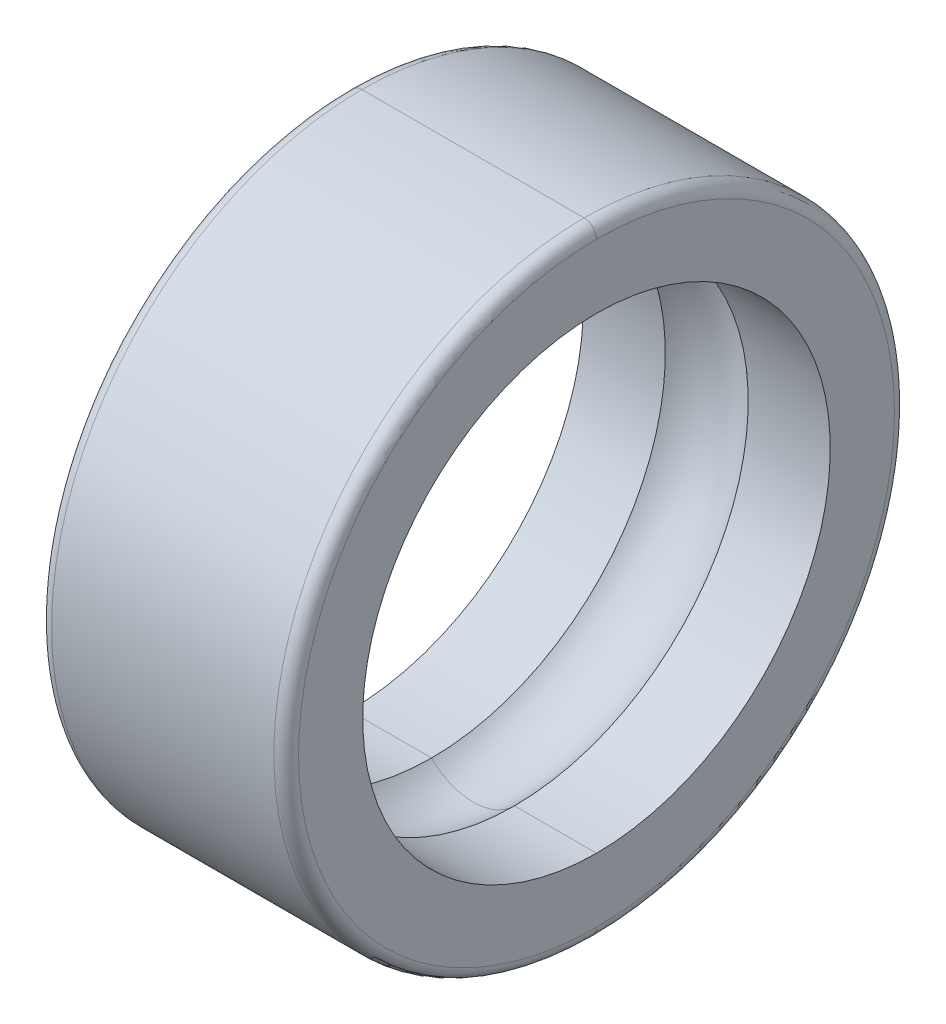
ISO-10303-21;
HEADER;
FILE_DESCRIPTION(('STEP AP214'),'2;1');
FILE_NAME('part.step','',(''),(''),'','','');
FILE_SCHEMA(('AUTOMOTIVE_DESIGN { 1 0 10303 214 1 1 1 1 }'));
ENDSEC;
DATA;
#1=APPLICATION_CONTEXT('core data for automotive mechanical design processes');
#2=APPLICATION_PROTOCOL_DEFINITION('international standard','automotive_design',2000,#1);
#3=PRODUCT_CONTEXT('',#1,'mechanical');
#4=PRODUCT('Part','Part','',(#3));
#5=PRODUCT_RELATED_PRODUCT_CATEGORY('part','',(#4));
#6=PRODUCT_DEFINITION_FORMATION('','',#4);
#7=PRODUCT_DEFINITION_CONTEXT('part definition',#1,'design');
#8=PRODUCT_DEFINITION('design','',#6,#7);
#9=PRODUCT_DEFINITION_SHAPE('','',#8);
#10=(LENGTH_UNIT() NAMED_UNIT(*) SI_UNIT(.MILLI.,.METRE.));
#11=(NAMED_UNIT(*) PLANE_ANGLE_UNIT() SI_UNIT($,.RADIAN.));
#12=(NAMED_UNIT(*) SI_UNIT($,.STERADIAN.) SOLID_ANGLE_UNIT());
#13=UNCERTAINTY_MEASURE_WITH_UNIT(LENGTH_MEASURE(1.E-05),#10,'distance_accuracy_value','');
#14=(GEOMETRIC_REPRESENTATION_CONTEXT(3) GLOBAL_UNCERTAINTY_ASSIGNED_CONTEXT((#13)) GLOBAL_UNIT_ASSIGNED_CONTEXT((#10,
#11,#12)) REPRESENTATION_CONTEXT('',''));
#15=CARTESIAN_POINT('',(0.,0.,0.));
#16=DIRECTION('',(0.,0.,1.));
#17=DIRECTION('',(1.,0.,0.));
#18=AXIS2_PLACEMENT_3D('',#15,#16,#17);
#19=CARTESIAN_POINT('',(-0.544829999999999,0.,0.));
#20=DIRECTION('',(1.,0.,0.));
#21=DIRECTION('',(0.,-1.,0.));
#22=AXIS2_PLACEMENT_3D('',#19,#20,#21);
#23=CYLINDRICAL_SURFACE('',#22,0.9376537);
#24=CARTESIAN_POINT('',(0.495300000000001,0.,0.));
#25=DIRECTION('',(1.,0.,0.));
#26=DIRECTION('',(0.,1.,0.));
#27=AXIS2_PLACEMENT_3D('',#24,#25,#26);
#28=CIRCLE('',#27,0.9376537);
#29=CARTESIAN_POINT('',(0.4953,0.9376537,0.));
#30=VERTEX_POINT('',#29);
#31=CARTESIAN_POINT('',(0.4953,-0.9376537,0.));
#32=VERTEX_POINT('',#31);
#33=EDGE_CURVE('E97',#30,#32,#28,.T.);
#34=ORIENTED_EDGE('',*,*,#33,.T.);
#35=DIRECTION('',(1.,0.,0.));
#36=VECTOR('',#35,1.);
#37=CARTESIAN_POINT('',(0.166246026530892,-0.9376537,0.));
#38=LINE('',#37,#36);
#39=CARTESIAN_POINT('',(0.166246026530892,-0.9376537,0.));
#40=VERTEX_POINT('',#39);
#41=EDGE_CURVE('E11',#40,#32,#38,.T.);
#42=ORIENTED_EDGE('',*,*,#41,.F.);
#43=CARTESIAN_POINT('',(0.166246026530892,0.,0.));
#44=DIRECTION('',(1.,0.,0.));
#45=DIRECTION('',(0.,1.,0.));
#46=AXIS2_PLACEMENT_3D('',#43,#44,#45);
#47=CIRCLE('',#46,0.9376537);
#48=CARTESIAN_POINT('',(0.166246026530892,0.9376537,0.));
#49=VERTEX_POINT('',#48);
#50=EDGE_CURVE('E19',#49,#40,#47,.T.);
#51=ORIENTED_EDGE('',*,*,#50,.F.);
#52=DIRECTION('',(1.,0.,0.));
#53=VECTOR('',#52,1.);
#54=CARTESIAN_POINT('',(0.166246026530892,0.9376537,0.));
#55=LINE('',#54,#53);
#56=EDGE_CURVE('E24',#49,#30,#55,.T.);
#57=ORIENTED_EDGE('',*,*,#56,.T.);
#58=EDGE_LOOP('',(#34,#42,#51,#57));
#59=FACE_BOUND('',#58,.T.);
#60=ADVANCED_FACE('F16',(#59),#23,.F.);
#61=CARTESIAN_POINT('',(-0.544829999999999,0.,0.));
#62=DIRECTION('',(1.,0.,0.));
#63=DIRECTION('',(0.,-1.,0.));
#64=AXIS2_PLACEMENT_3D('',#61,#62,#63);
#65=CYLINDRICAL_SURFACE('',#64,0.9376537);
#66=CARTESIAN_POINT('',(0.166246026530892,0.,0.));
#67=DIRECTION('',(-1.,0.,0.));
#68=DIRECTION('',(0.,1.,0.));
#69=AXIS2_PLACEMENT_3D('',#66,#67,#68);
#70=CIRCLE('',#69,0.9376537);
#71=EDGE_CURVE('E93',#49,#40,#70,.T.);
#72=ORIENTED_EDGE('',*,*,#71,.T.);
#73=ORIENTED_EDGE('',*,*,#41,.T.);
#74=CARTESIAN_POINT('',(0.495300000000001,0.,0.));
#75=DIRECTION('',(-1.,0.,0.));
#76=DIRECTION('',(0.,1.,0.));
#77=AXIS2_PLACEMENT_3D('',#74,#75,#76);
#78=CIRCLE('',#77,0.9376537);
#79=EDGE_CURVE('E95',#30,#32,#78,.T.);
#80=ORIENTED_EDGE('',*,*,#79,.F.);
#81=ORIENTED_EDGE('',*,*,#56,.F.);
#82=EDGE_LOOP('',(#72,#73,#80,#81));
#83=FACE_BOUND('',#82,.T.);
#84=ADVANCED_FACE('F91',(#83),#65,.F.);
#85=CARTESIAN_POINT('',(0.4953,0.,0.));
#86=DIRECTION('',(1.,0.,0.));
#87=DIRECTION('',(0.,-1.,0.));
#88=AXIS2_PLACEMENT_3D('',#85,#86,#87);
#89=PLANE('',#88);
#90=ORIENTED_EDGE('',*,*,#33,.F.);
#91=ORIENTED_EDGE('',*,*,#79,.T.);
#92=EDGE_LOOP('',(#90,#91));
#93=FACE_BOUND('',#92,.T.);
#94=CARTESIAN_POINT('',(0.4953,0.,0.));
#95=DIRECTION('',(-1.,0.,0.));
#96=DIRECTION('',(0.,1.,0.));
#97=AXIS2_PLACEMENT_3D('',#94,#95,#96);
#98=CIRCLE('',#97,1.19507);
#99=CARTESIAN_POINT('',(0.4953,1.19507,0.));
#100=VERTEX_POINT('',#99);
#101=CARTESIAN_POINT('',(0.4953,-1.19507,0.));
#102=VERTEX_POINT('',#101);
#103=EDGE_CURVE('E115',#100,#102,#98,.T.);
#104=ORIENTED_EDGE('',*,*,#103,.F.);
#105=CARTESIAN_POINT('',(0.4953,0.,0.));
#106=DIRECTION('',(1.,0.,0.));
#107=DIRECTION('',(0.,1.,0.));
#108=AXIS2_PLACEMENT_3D('',#105,#106,#107);
#109=CIRCLE('',#108,1.19507);
#110=EDGE_CURVE('E113',#100,#102,#109,.T.);
#111=ORIENTED_EDGE('',*,*,#110,.T.);
#112=EDGE_LOOP('',(#104,#111));
#113=FACE_BOUND('',#112,.T.);
#114=ADVANCED_FACE('F174',(#93,#113),#89,.T.);
#115=CARTESIAN_POINT('',(0.44577,0.,0.));
#116=DIRECTION('',(1.,0.,0.));
#117=DIRECTION('',(0.,-1.,0.));
#118=AXIS2_PLACEMENT_3D('',#115,#116,#117);
#119=TOROIDAL_SURFACE('',#118,1.19507,0.04953);
#120=CARTESIAN_POINT('',(0.445769999999999,0.,0.));
#121=DIRECTION('',(1.,0.,0.));
#122=DIRECTION('',(0.,1.,0.));
#123=AXIS2_PLACEMENT_3D('',#120,#121,#122);
#124=CIRCLE('',#123,1.2446);
#125=CARTESIAN_POINT('',(0.44577,1.2446,0.));
#126=VERTEX_POINT('',#125);
#127=CARTESIAN_POINT('',(0.44577,-1.2446,0.));
#128=VERTEX_POINT('',#127);
#129=EDGE_CURVE('E128',#126,#128,#124,.T.);
#130=ORIENTED_EDGE('',*,*,#129,.T.);
#131=CARTESIAN_POINT('',(0.44577,-1.19507,0.));
#132=DIRECTION('',(0.,0.,-1.));
#133=DIRECTION('',(1.,0.,0.));
#134=AXIS2_PLACEMENT_3D('',#131,#132,#133);
#135=CIRCLE('',#134,0.04953);
#136=EDGE_CURVE('E118',#102,#128,#135,.T.);
#137=ORIENTED_EDGE('',*,*,#136,.F.);
#138=ORIENTED_EDGE('',*,*,#110,.F.);
#139=CARTESIAN_POINT('',(0.44577,1.19507,0.));
#140=DIRECTION('',(0.,0.,1.));
#141=DIRECTION('',(1.,0.,0.));
#142=AXIS2_PLACEMENT_3D('',#139,#140,#141);
#143=CIRCLE('',#142,0.04953);
#144=EDGE_CURVE('E121',#100,#126,#143,.T.);
#145=ORIENTED_EDGE('',*,*,#144,.T.);
#146=EDGE_LOOP('',(#130,#137,#138,#145));
#147=FACE_BOUND('',#146,.T.);
#148=ADVANCED_FACE('F178',(#147),#119,.T.);
#149=CARTESIAN_POINT('',(0.44577,0.,0.));
#150=DIRECTION('',(1.,0.,0.));
#151=DIRECTION('',(0.,-1.,0.));
#152=AXIS2_PLACEMENT_3D('',#149,#150,#151);
#153=TOROIDAL_SURFACE('',#152,1.19507,0.04953);
#154=ORIENTED_EDGE('',*,*,#103,.T.);
#155=ORIENTED_EDGE('',*,*,#136,.T.);
#156=CARTESIAN_POINT('',(0.445769999999999,0.,0.));
#157=DIRECTION('',(-1.,0.,0.));
#158=DIRECTION('',(0.,1.,0.));
#159=AXIS2_PLACEMENT_3D('',#156,#157,#158);
#160=CIRCLE('',#159,1.2446);
#161=EDGE_CURVE('E123',#126,#128,#160,.T.);
#162=ORIENTED_EDGE('',*,*,#161,.F.);
#163=ORIENTED_EDGE('',*,*,#144,.F.);
#164=EDGE_LOOP('',(#154,#155,#162,#163));
#165=FACE_BOUND('',#164,.T.);
#166=ADVANCED_FACE('F184',(#165),#153,.T.);
#167=CARTESIAN_POINT('',(-0.544829999999999,0.,0.));
#168=DIRECTION('',(1.,0.,0.));
#169=DIRECTION('',(0.,-1.,0.));
#170=AXIS2_PLACEMENT_3D('',#167,#168,#169);
#171=CYLINDRICAL_SURFACE('',#170,1.2446);
#172=ORIENTED_EDGE('',*,*,#161,.T.);
#173=DIRECTION('',(-1.,0.,0.));
#174=VECTOR('',#173,1.);
#175=CARTESIAN_POINT('',(0.44577,-1.2446,0.));
#176=LINE('',#175,#174);
#177=CARTESIAN_POINT('',(-0.44577,-1.2446,0.));
#178=VERTEX_POINT('',#177);
#179=EDGE_CURVE('E126',#128,#178,#176,.T.);
#180=ORIENTED_EDGE('',*,*,#179,.T.);
#181=CARTESIAN_POINT('',(-0.44577,0.,0.));
#182=DIRECTION('',(-1.,0.,0.));
#183=DIRECTION('',(0.,1.,0.));
#184=AXIS2_PLACEMENT_3D('',#181,#182,#183);
#185=CIRCLE('',#184,1.2446);
#186=CARTESIAN_POINT('',(-0.44577,1.2446,0.));
#187=VERTEX_POINT('',#186);
#188=EDGE_CURVE('E136',#187,#178,#185,.T.);
#189=ORIENTED_EDGE('',*,*,#188,.F.);
#190=DIRECTION('',(-1.,0.,0.));
#191=VECTOR('',#190,1.);
#192=CARTESIAN_POINT('',(0.44577,1.2446,0.));
#193=LINE('',#192,#191);
#194=EDGE_CURVE('E129',#126,#187,#193,.T.);
#195=ORIENTED_EDGE('',*,*,#194,.F.);
#196=EDGE_LOOP('',(#172,#180,#189,#195));
#197=FACE_BOUND('',#196,.T.);
#198=ADVANCED_FACE('F188',(#197),#171,.T.);
#199=CARTESIAN_POINT('',(-0.544829999999999,0.,0.));
#200=DIRECTION('',(1.,0.,0.));
#201=DIRECTION('',(0.,-1.,0.));
#202=AXIS2_PLACEMENT_3D('',#199,#200,#201);
#203=CYLINDRICAL_SURFACE('',#202,1.2446);
#204=CARTESIAN_POINT('',(-0.44577,0.,0.));
#205=DIRECTION('',(1.,0.,0.));
#206=DIRECTION('',(0.,1.,0.));
#207=AXIS2_PLACEMENT_3D('',#204,#205,#206);
#208=CIRCLE('',#207,1.2446);
#209=EDGE_CURVE('E132',#187,#178,#208,.T.);
#210=ORIENTED_EDGE('',*,*,#209,.T.);
#211=ORIENTED_EDGE('',*,*,#179,.F.);
#212=ORIENTED_EDGE('',*,*,#129,.F.);
#213=ORIENTED_EDGE('',*,*,#194,.T.);
#214=EDGE_LOOP('',(#210,#211,#212,#213));
#215=FACE_BOUND('',#214,.T.);
#216=ADVANCED_FACE('F192',(#215),#203,.T.);
#217=CARTESIAN_POINT('',(-0.44577,0.,0.));
#218=DIRECTION('',(1.,0.,0.));
#219=DIRECTION('',(0.,-1.,0.));
#220=AXIS2_PLACEMENT_3D('',#217,#218,#219);
#221=TOROIDAL_SURFACE('',#220,1.19507,0.04953);
#222=CARTESIAN_POINT('',(-0.4953,0.,0.));
#223=DIRECTION('',(1.,0.,0.));
#224=DIRECTION('',(0.,1.,0.));
#225=AXIS2_PLACEMENT_3D('',#222,#223,#224);
#226=CIRCLE('',#225,1.19507);
#227=CARTESIAN_POINT('',(-0.4953,1.19507,0.));
#228=VERTEX_POINT('',#227);
#229=CARTESIAN_POINT('',(-0.4953,-1.19507,0.));
#230=VERTEX_POINT('',#229);
#231=EDGE_CURVE('E144',#228,#230,#226,.T.);
#232=ORIENTED_EDGE('',*,*,#231,.T.);
#233=CARTESIAN_POINT('',(-0.44577,-1.19507,0.));
#234=DIRECTION('',(0.,0.,-1.));
#235=DIRECTION('',(0.,-1.,0.));
#236=AXIS2_PLACEMENT_3D('',#233,#234,#235);
#237=CIRCLE('',#236,0.04953);
#238=EDGE_CURVE('E139',#178,#230,#237,.T.);
#239=ORIENTED_EDGE('',*,*,#238,.F.);
#240=ORIENTED_EDGE('',*,*,#209,.F.);
#241=CARTESIAN_POINT('',(-0.44577,1.19507,0.));
#242=DIRECTION('',(0.,0.,1.));
#243=DIRECTION('',(0.,1.,0.));
#244=AXIS2_PLACEMENT_3D('',#241,#242,#243);
#245=CIRCLE('',#244,0.04953);
#246=EDGE_CURVE('E142',#187,#228,#245,.T.);
#247=ORIENTED_EDGE('',*,*,#246,.T.);
#248=EDGE_LOOP('',(#232,#239,#240,#247));
#249=FACE_BOUND('',#248,.T.);
#250=ADVANCED_FACE('F196',(#249),#221,.T.);
#251=CARTESIAN_POINT('',(-0.44577,0.,0.));
#252=DIRECTION('',(1.,0.,0.));
#253=DIRECTION('',(0.,-1.,0.));
#254=AXIS2_PLACEMENT_3D('',#251,#252,#253);
#255=TOROIDAL_SURFACE('',#254,1.19507,0.04953);
#256=ORIENTED_EDGE('',*,*,#188,.T.);
#257=ORIENTED_EDGE('',*,*,#238,.T.);
#258=CARTESIAN_POINT('',(-0.4953,0.,0.));
#259=DIRECTION('',(-1.,0.,0.));
#260=DIRECTION('',(0.,1.,0.));
#261=AXIS2_PLACEMENT_3D('',#258,#259,#260);
#262=CIRCLE('',#261,1.19507);
#263=EDGE_CURVE('E146',#228,#230,#262,.T.);
#264=ORIENTED_EDGE('',*,*,#263,.F.);
#265=ORIENTED_EDGE('',*,*,#246,.F.);
#266=EDGE_LOOP('',(#256,#257,#264,#265));
#267=FACE_BOUND('',#266,.T.);
#268=ADVANCED_FACE('F200',(#267),#255,.T.);
#269=CARTESIAN_POINT('',(-0.4953,0.,0.));
#270=DIRECTION('',(1.,0.,0.));
#271=DIRECTION('',(0.,-1.,0.));
#272=AXIS2_PLACEMENT_3D('',#269,#270,#271);
#273=PLANE('',#272);
#274=CARTESIAN_POINT('',(-0.4953,0.,0.));
#275=DIRECTION('',(-1.,0.,0.));
#276=DIRECTION('',(0.,1.,0.));
#277=AXIS2_PLACEMENT_3D('',#274,#275,#276);
#278=CIRCLE('',#277,0.9376537);
#279=CARTESIAN_POINT('',(-0.4953,0.9376537,0.));
#280=VERTEX_POINT('',#279);
#281=CARTESIAN_POINT('',(-0.4953,-0.9376537,0.));
#282=VERTEX_POINT('',#281);
#283=EDGE_CURVE('E149',#280,#282,#278,.T.);
#284=ORIENTED_EDGE('',*,*,#283,.F.);
#285=CARTESIAN_POINT('',(-0.4953,0.,0.));
#286=DIRECTION('',(1.,0.,0.));
#287=DIRECTION('',(0.,1.,0.));
#288=AXIS2_PLACEMENT_3D('',#285,#286,#287);
#289=CIRCLE('',#288,0.9376537);
#290=EDGE_CURVE('E39',#280,#282,#289,.T.);
#291=ORIENTED_EDGE('',*,*,#290,.T.);
#292=EDGE_LOOP('',(#284,#291));
#293=FACE_BOUND('',#292,.T.);
#294=ORIENTED_EDGE('',*,*,#231,.F.);
#295=ORIENTED_EDGE('',*,*,#263,.T.);
#296=EDGE_LOOP('',(#294,#295));
#297=FACE_BOUND('',#296,.T.);
#298=ADVANCED_FACE('F168',(#293,#297),#273,.F.);
#299=CARTESIAN_POINT('',(-0.544829999999999,0.,0.));
#300=DIRECTION('',(1.,0.,0.));
#301=DIRECTION('',(0.,-1.,0.));
#302=AXIS2_PLACEMENT_3D('',#299,#300,#301);
#303=CYLINDRICAL_SURFACE('',#302,0.9376537);
#304=ORIENTED_EDGE('',*,*,#283,.T.);
#305=DIRECTION('',(1.,0.,0.));
#306=VECTOR('',#305,1.);
#307=CARTESIAN_POINT('',(-0.4953,-0.9376537,0.));
#308=LINE('',#307,#306);
#309=CARTESIAN_POINT('',(-0.166246026530892,-0.9376537,0.));
#310=VERTEX_POINT('',#309);
#311=EDGE_CURVE('E32',#282,#310,#308,.T.);
#312=ORIENTED_EDGE('',*,*,#311,.T.);
#313=CARTESIAN_POINT('',(-0.166246026530892,0.,0.));
#314=DIRECTION('',(-1.,0.,0.));
#315=DIRECTION('',(0.,1.,0.));
#316=AXIS2_PLACEMENT_3D('',#313,#314,#315);
#317=CIRCLE('',#316,0.9376537);
#318=CARTESIAN_POINT('',(-0.166246026530892,0.9376537,0.));
#319=VERTEX_POINT('',#318);
#320=EDGE_CURVE('E108',#319,#310,#317,.T.);
#321=ORIENTED_EDGE('',*,*,#320,.F.);
#322=DIRECTION('',(1.,0.,0.));
#323=VECTOR('',#322,1.);
#324=CARTESIAN_POINT('',(-0.4953,0.9376537,0.));
#325=LINE('',#324,#323);
#326=EDGE_CURVE('E88',#280,#319,#325,.T.);
#327=ORIENTED_EDGE('',*,*,#326,.F.);
#328=EDGE_LOOP('',(#304,#312,#321,#327));
#329=FACE_BOUND('',#328,.T.);
#330=ADVANCED_FACE('F157',(#329),#303,.F.);
#331=CARTESIAN_POINT('',(-0.544829999999999,0.,0.));
#332=DIRECTION('',(1.,0.,0.));
#333=DIRECTION('',(0.,-1.,0.));
#334=AXIS2_PLACEMENT_3D('',#331,#332,#333);
#335=CYLINDRICAL_SURFACE('',#334,0.9376537);
#336=CARTESIAN_POINT('',(-0.166246026530892,0.,0.));
#337=DIRECTION('',(1.,0.,0.));
#338=DIRECTION('',(0.,1.,0.));
#339=AXIS2_PLACEMENT_3D('',#336,#337,#338);
#340=CIRCLE('',#339,0.9376537);
#341=EDGE_CURVE('E89',#319,#310,#340,.T.);
#342=ORIENTED_EDGE('',*,*,#341,.T.);
#343=ORIENTED_EDGE('',*,*,#311,.F.);
#344=ORIENTED_EDGE('',*,*,#290,.F.);
#345=ORIENTED_EDGE('',*,*,#326,.T.);
#346=EDGE_LOOP('',(#342,#343,#344,#345));
#347=FACE_BOUND('',#346,.T.);
#348=ADVANCED_FACE('F159',(#347),#335,.F.);
#349=CARTESIAN_POINT('',(0.,0.,0.));
#350=DIRECTION('',(1.,0.,0.));
#351=DIRECTION('',(0.,-1.,0.));
#352=AXIS2_PLACEMENT_3D('',#349,#350,#351);
#353=TOROIDAL_SURFACE('',#352,0.7747,0.232791);
#354=ORIENTED_EDGE('',*,*,#50,.T.);
#355=CARTESIAN_POINT('',(0.,-0.7747,0.));
#356=DIRECTION('',(0.,0.,1.));
#357=DIRECTION('',(-0.714142842854285,-0.7,0.));
#358=AXIS2_PLACEMENT_3D('',#355,#356,#357);
#359=CIRCLE('',#358,0.232791);
#360=EDGE_CURVE('E107',#310,#40,#359,.T.);
#361=ORIENTED_EDGE('',*,*,#360,.F.);
#362=ORIENTED_EDGE('',*,*,#341,.F.);
#363=CARTESIAN_POINT('',(0.,0.7747,0.));
#364=DIRECTION('',(0.,0.,-1.));
#365=DIRECTION('',(-0.714142842854285,0.7,0.));
#366=AXIS2_PLACEMENT_3D('',#363,#364,#365);
#367=CIRCLE('',#366,0.232791);
#368=EDGE_CURVE('E101',#319,#49,#367,.T.);
#369=ORIENTED_EDGE('',*,*,#368,.T.);
#370=EDGE_LOOP('',(#354,#361,#362,#369));
#371=FACE_BOUND('',#370,.T.);
#372=ADVANCED_FACE('F102',(#371),#353,.F.);
#373=CARTESIAN_POINT('',(0.,0.,0.));
#374=DIRECTION('',(1.,0.,0.));
#375=DIRECTION('',(0.,-1.,0.));
#376=AXIS2_PLACEMENT_3D('',#373,#374,#375);
#377=TOROIDAL_SURFACE('',#376,0.7747,0.232791);
#378=ORIENTED_EDGE('',*,*,#320,.T.);
#379=ORIENTED_EDGE('',*,*,#360,.T.);
#380=ORIENTED_EDGE('',*,*,#71,.F.);
#381=ORIENTED_EDGE('',*,*,#368,.F.);
#382=EDGE_LOOP('',(#378,#379,#380,#381));
#383=FACE_BOUND('',#382,.T.);
#384=ADVANCED_FACE('F106',(#383),#377,.F.);
#385=CLOSED_SHELL('',(#60,#84,#114,#148,#166,#198,#216,#250,#268,#298,#330,#348,#372,#384));
#386=MANIFOLD_SOLID_BREP('B1',#385);
#387=ADVANCED_BREP_SHAPE_REPRESENTATION('',(#18,#386),#14);
#388=SHAPE_DEFINITION_REPRESENTATION(#9,#387);
ENDSEC;
END-ISO-10303-21;
